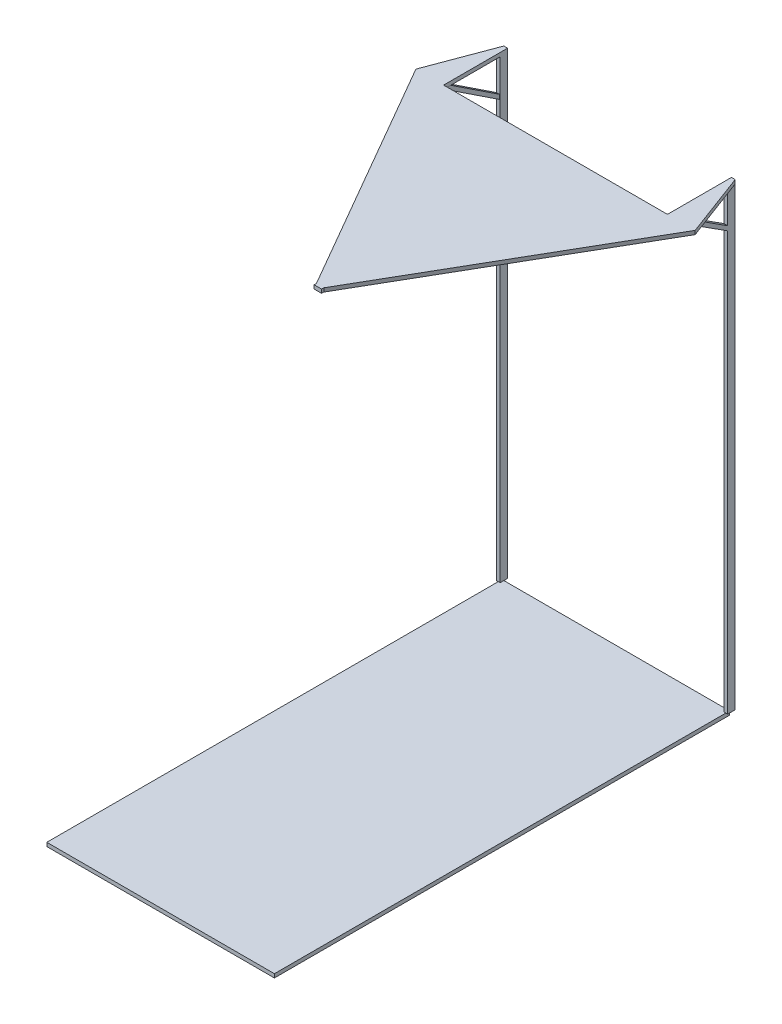
ISO-10303-21;
HEADER;
FILE_DESCRIPTION(('STEP AP214'),'2;1');
FILE_NAME('part.step','',(''),(''),'','','');
FILE_SCHEMA(('AUTOMOTIVE_DESIGN { 1 0 10303 214 1 1 1 1 }'));
ENDSEC;
DATA;
#1=APPLICATION_CONTEXT('core data for automotive mechanical design processes');
#2=APPLICATION_PROTOCOL_DEFINITION('international standard','automotive_design',2000,#1);
#3=PRODUCT_CONTEXT('',#1,'mechanical');
#4=PRODUCT('Part','Part','',(#3));
#5=PRODUCT_RELATED_PRODUCT_CATEGORY('part','',(#4));
#6=PRODUCT_DEFINITION_FORMATION('','',#4);
#7=PRODUCT_DEFINITION_CONTEXT('part definition',#1,'design');
#8=PRODUCT_DEFINITION('design','',#6,#7);
#9=PRODUCT_DEFINITION_SHAPE('','',#8);
#10=(LENGTH_UNIT() NAMED_UNIT(*) SI_UNIT(.MILLI.,.METRE.));
#11=(NAMED_UNIT(*) PLANE_ANGLE_UNIT() SI_UNIT($,.RADIAN.));
#12=(NAMED_UNIT(*) SI_UNIT($,.STERADIAN.) SOLID_ANGLE_UNIT());
#13=UNCERTAINTY_MEASURE_WITH_UNIT(LENGTH_MEASURE(1.E-05),#10,'distance_accuracy_value','');
#14=(GEOMETRIC_REPRESENTATION_CONTEXT(3) GLOBAL_UNCERTAINTY_ASSIGNED_CONTEXT((#13)) GLOBAL_UNIT_ASSIGNED_CONTEXT((#10,
#11,#12)) REPRESENTATION_CONTEXT('',''));
#15=CARTESIAN_POINT('',(0.,0.,0.));
#16=DIRECTION('',(0.,0.,1.));
#17=DIRECTION('',(1.,0.,0.));
#18=AXIS2_PLACEMENT_3D('',#15,#16,#17);
#19=CARTESIAN_POINT('',(0.,615.,0.));
#20=DIRECTION('',(0.,-1.,0.));
#21=DIRECTION('',(0.,0.,-1.));
#22=AXIS2_PLACEMENT_3D('',#19,#20,#21);
#23=PLANE('',#22);
#24=DIRECTION('',(0.,0.,1.));
#25=VECTOR('',#24,1.);
#26=CARTESIAN_POINT('',(-150.9,615.,0.));
#27=LINE('',#26,#25);
#28=CARTESIAN_POINT('',(-150.9,615.,-233.171995957836));
#29=VERTEX_POINT('',#28);
#30=CARTESIAN_POINT('',(-150.9,615.,-224.099772141224));
#31=VERTEX_POINT('',#30);
#32=EDGE_CURVE('E409',#29,#31,#27,.T.);
#33=ORIENTED_EDGE('',*,*,#32,.F.);
#34=DIRECTION('',(1.,0.,0.));
#35=VECTOR('',#34,1.);
#36=CARTESIAN_POINT('',(0.,615.,-233.171995957836));
#37=LINE('',#36,#35);
#38=CARTESIAN_POINT('',(-154.9,615.,-233.171995957836));
#39=VERTEX_POINT('',#38);
#40=EDGE_CURVE('E407',#39,#29,#37,.T.);
#41=ORIENTED_EDGE('',*,*,#40,.F.);
#42=DIRECTION('',(0.,0.,1.));
#43=VECTOR('',#42,1.);
#44=CARTESIAN_POINT('',(-154.9,615.,0.));
#45=LINE('',#44,#43);
#46=CARTESIAN_POINT('',(-154.9,615.,-224.099772141224));
#47=VERTEX_POINT('',#46);
#48=EDGE_CURVE('E404',#39,#47,#45,.T.);
#49=ORIENTED_EDGE('',*,*,#48,.T.);
#50=DIRECTION('',(-1.,0.,0.));
#51=VECTOR('',#50,1.);
#52=CARTESIAN_POINT('',(-150.9,615.,-224.099772141224));
#53=LINE('',#52,#51);
#54=EDGE_CURVE('E457',#31,#47,#53,.T.);
#55=ORIENTED_EDGE('',*,*,#54,.F.);
#56=EDGE_LOOP('',(#33,#41,#49,#55));
#57=FACE_BOUND('',#56,.T.);
#58=DIRECTION('',(0.,0.,-1.));
#59=VECTOR('',#58,1.);
#60=CARTESIAN_POINT('',(4.99999999999996,615.,91.1334748363122));
#61=LINE('',#60,#59);
#62=CARTESIAN_POINT('',(5.,615.,94.1430586713743));
#63=VERTEX_POINT('',#62);
#64=CARTESIAN_POINT('',(4.99999999999996,615.,91.1334748363122));
#65=VERTEX_POINT('',#64);
#66=EDGE_CURVE('E266',#63,#65,#61,.T.);
#67=ORIENTED_EDGE('',*,*,#66,.F.);
#68=DIRECTION('',(-1.,0.,0.));
#69=VECTOR('',#68,1.);
#70=CARTESIAN_POINT('',(0.,615.,94.1430586713743));
#71=LINE('',#70,#69);
#72=CARTESIAN_POINT('',(-4.99999999999999,615.,94.1430586713743));
#73=VERTEX_POINT('',#72);
#74=EDGE_CURVE('E252',#63,#73,#71,.T.);
#75=ORIENTED_EDGE('',*,*,#74,.T.);
#76=DIRECTION('',(0.,0.,1.));
#77=VECTOR('',#76,1.);
#78=CARTESIAN_POINT('',(-4.99999999999999,615.,99.7999999999999));
#79=LINE('',#78,#77);
#80=CARTESIAN_POINT('',(-4.99999999999993,615.,91.1334748363122));
#81=VERTEX_POINT('',#80);
#82=EDGE_CURVE('E251',#81,#73,#79,.T.);
#83=ORIENTED_EDGE('',*,*,#82,.F.);
#84=DIRECTION('',(0.5,0.,0.866025403784439));
#85=VECTOR('',#84,1.);
#86=CARTESIAN_POINT('',(-187.,615.,-224.099772141224));
#87=LINE('',#86,#85);
#88=CARTESIAN_POINT('',(-187.,615.,-224.099772141224));
#89=VERTEX_POINT('',#88);
#90=EDGE_CURVE('E284',#89,#81,#87,.T.);
#91=ORIENTED_EDGE('',*,*,#90,.F.);
#92=DIRECTION('',(-0.350763346399041,0.,0.936464134296101));
#93=VECTOR('',#92,1.);
#94=CARTESIAN_POINT('',(-154.9,615.,-309.8));
#95=LINE('',#94,#93);
#96=CARTESIAN_POINT('',(-154.9,615.,-309.8));
#97=VERTEX_POINT('',#96);
#98=EDGE_CURVE('E282',#97,#89,#95,.T.);
#99=ORIENTED_EDGE('',*,*,#98,.F.);
#100=DIRECTION('',(0.,0.,1.));
#101=VECTOR('',#100,1.);
#102=CARTESIAN_POINT('',(-154.9,615.,-309.8));
#103=LINE('',#102,#101);
#104=CARTESIAN_POINT('',(-154.9,615.,-299.8));
#105=VERTEX_POINT('',#104);
#106=EDGE_CURVE('E313',#97,#105,#103,.T.);
#107=ORIENTED_EDGE('',*,*,#106,.T.);
#108=DIRECTION('',(1.,0.,0.));
#109=VECTOR('',#108,1.);
#110=CARTESIAN_POINT('',(-154.9,615.,-299.8));
#111=LINE('',#110,#109);
#112=CARTESIAN_POINT('',(-149.9,615.,-299.8));
#113=VERTEX_POINT('',#112);
#114=EDGE_CURVE('E336',#105,#113,#111,.T.);
#115=ORIENTED_EDGE('',*,*,#114,.T.);
#116=DIRECTION('',(0.,0.,-1.));
#117=VECTOR('',#116,1.);
#118=CARTESIAN_POINT('',(-149.9,615.,-224.099772141224));
#119=LINE('',#118,#117);
#120=CARTESIAN_POINT('',(-149.9,615.,-224.099772141224));
#121=VERTEX_POINT('',#120);
#122=EDGE_CURVE('E279',#121,#113,#119,.T.);
#123=ORIENTED_EDGE('',*,*,#122,.F.);
#124=DIRECTION('',(-1.,0.,0.));
#125=VECTOR('',#124,1.);
#126=CARTESIAN_POINT('',(-149.9,615.,-224.099772141224));
#127=LINE('',#126,#125);
#128=CARTESIAN_POINT('',(149.9,615.,-224.099772141224));
#129=VERTEX_POINT('',#128);
#130=EDGE_CURVE('E277',#129,#121,#127,.T.);
#131=ORIENTED_EDGE('',*,*,#130,.F.);
#132=DIRECTION('',(0.,0.,-1.));
#133=VECTOR('',#132,1.);
#134=CARTESIAN_POINT('',(149.9,615.,0.));
#135=LINE('',#134,#133);
#136=CARTESIAN_POINT('',(149.9,615.,-222.633348802618));
#137=VERTEX_POINT('',#136);
#138=EDGE_CURVE('E426',#137,#129,#135,.T.);
#139=ORIENTED_EDGE('',*,*,#138,.F.);
#140=DIRECTION('',(-1.,0.,0.));
#141=VECTOR('',#140,1.);
#142=CARTESIAN_POINT('',(0.,615.,-222.633348802618));
#143=LINE('',#142,#141);
#144=CARTESIAN_POINT('',(154.9,615.,-222.633348802618));
#145=VERTEX_POINT('',#144);
#146=EDGE_CURVE('E47',#145,#137,#143,.T.);
#147=ORIENTED_EDGE('',*,*,#146,.F.);
#148=DIRECTION('',(0.,0.,-1.));
#149=VECTOR('',#148,1.);
#150=CARTESIAN_POINT('',(154.9,615.,0.));
#151=LINE('',#150,#149);
#152=CARTESIAN_POINT('',(154.9,615.,-231.890701946567));
#153=VERTEX_POINT('',#152);
#154=EDGE_CURVE('E435',#145,#153,#151,.T.);
#155=ORIENTED_EDGE('',*,*,#154,.T.);
#156=DIRECTION('',(-1.,0.,0.));
#157=VECTOR('',#156,1.);
#158=CARTESIAN_POINT('',(0.,615.,-231.890701946567));
#159=LINE('',#158,#157);
#160=CARTESIAN_POINT('',(149.9,615.,-231.890701946567));
#161=VERTEX_POINT('',#160);
#162=EDGE_CURVE('E434',#153,#161,#159,.T.);
#163=ORIENTED_EDGE('',*,*,#162,.T.);
#164=DIRECTION('',(0.,0.,1.));
#165=VECTOR('',#164,1.);
#166=CARTESIAN_POINT('',(149.9,615.,-309.8));
#167=LINE('',#166,#165);
#168=CARTESIAN_POINT('',(149.9,615.,-299.8));
#169=VERTEX_POINT('',#168);
#170=EDGE_CURVE('E274',#169,#161,#167,.T.);
#171=ORIENTED_EDGE('',*,*,#170,.F.);
#172=DIRECTION('',(-1.,0.,0.));
#173=VECTOR('',#172,1.);
#174=CARTESIAN_POINT('',(154.9,615.,-299.8));
#175=LINE('',#174,#173);
#176=CARTESIAN_POINT('',(154.9,615.,-299.8));
#177=VERTEX_POINT('',#176);
#178=EDGE_CURVE('E339',#177,#169,#175,.T.);
#179=ORIENTED_EDGE('',*,*,#178,.F.);
#180=DIRECTION('',(0.,0.,-1.));
#181=VECTOR('',#180,1.);
#182=CARTESIAN_POINT('',(154.9,615.,-299.8));
#183=LINE('',#182,#181);
#184=CARTESIAN_POINT('',(154.9,615.,-309.8));
#185=VERTEX_POINT('',#184);
#186=EDGE_CURVE('E365',#177,#185,#183,.T.);
#187=ORIENTED_EDGE('',*,*,#186,.T.);
#188=DIRECTION('',(-0.350763346399043,0.,-0.9364641342961));
#189=VECTOR('',#188,1.);
#190=CARTESIAN_POINT('',(187.,615.,-224.099772141224));
#191=LINE('',#190,#189);
#192=CARTESIAN_POINT('',(187.,615.,-224.099772141224));
#193=VERTEX_POINT('',#192);
#194=EDGE_CURVE('E271',#193,#185,#191,.T.);
#195=ORIENTED_EDGE('',*,*,#194,.F.);
#196=DIRECTION('',(0.5,0.,-0.866025403784439));
#197=VECTOR('',#196,1.);
#198=CARTESIAN_POINT('',(187.,615.,-224.099772141224));
#199=LINE('',#198,#197);
#200=EDGE_CURVE('E268',#65,#193,#199,.T.);
#201=ORIENTED_EDGE('',*,*,#200,.F.);
#202=EDGE_LOOP('',(#67,#75,#83,#91,#99,#107,#115,#123,#131,#139,#147,#155,#163,#171,#179,#187,
#195,#201));
#203=FACE_BOUND('',#202,.T.);
#204=ADVANCED_FACE('F39',(#57,#203),#23,.T.);
#205=CARTESIAN_POINT('',(4.99999999999996,620.,91.1334748363122));
#206=DIRECTION('',(-1.,0.,0.));
#207=DIRECTION('',(0.,0.,1.));
#208=AXIS2_PLACEMENT_3D('',#205,#206,#207);
#209=PLANE('',#208);
#210=DIRECTION('',(0.,1.,0.));
#211=VECTOR('',#210,1.);
#212=CARTESIAN_POINT('',(4.99999999999997,620.,94.1430586713743));
#213=LINE('',#212,#211);
#214=CARTESIAN_POINT('',(5.00000000000002,620.,94.1430586713743));
#215=VERTEX_POINT('',#214);
#216=EDGE_CURVE('E53',#63,#215,#213,.T.);
#217=ORIENTED_EDGE('',*,*,#216,.F.);
#218=ORIENTED_EDGE('',*,*,#66,.T.);
#219=DIRECTION('',(0.,-1.,0.));
#220=VECTOR('',#219,1.);
#221=CARTESIAN_POINT('',(4.99999999999996,620.,91.1334748363122));
#222=LINE('',#221,#220);
#223=CARTESIAN_POINT('',(4.99999999999996,620.,91.1334748363122));
#224=VERTEX_POINT('',#223);
#225=EDGE_CURVE('E306',#224,#65,#222,.T.);
#226=ORIENTED_EDGE('',*,*,#225,.F.);
#227=DIRECTION('',(0.,0.,-1.));
#228=VECTOR('',#227,1.);
#229=CARTESIAN_POINT('',(5.00000000000002,620.,104.787457748313));
#230=LINE('',#229,#228);
#231=EDGE_CURVE('E287',#215,#224,#230,.T.);
#232=ORIENTED_EDGE('',*,*,#231,.F.);
#233=EDGE_LOOP('',(#217,#218,#226,#232));
#234=FACE_BOUND('',#233,.T.);
#235=ADVANCED_FACE('F607',(#234),#209,.F.);
#236=CARTESIAN_POINT('',(-4.99999999999999,620.,99.7999999999999));
#237=DIRECTION('',(1.,0.,0.));
#238=DIRECTION('',(0.,0.,-1.));
#239=AXIS2_PLACEMENT_3D('',#236,#237,#238);
#240=PLANE('',#239);
#241=DIRECTION('',(0.,-1.,0.));
#242=VECTOR('',#241,1.);
#243=CARTESIAN_POINT('',(-4.99999999999999,620.,94.1430586713743));
#244=LINE('',#243,#242);
#245=CARTESIAN_POINT('',(-4.99999999999995,620.,94.1430586713743));
#246=VERTEX_POINT('',#245);
#247=EDGE_CURVE('E240',#246,#73,#244,.T.);
#248=ORIENTED_EDGE('',*,*,#247,.F.);
#249=DIRECTION('',(0.,0.,1.));
#250=VECTOR('',#249,1.);
#251=CARTESIAN_POINT('',(-4.99999999999999,620.,99.7999999999999));
#252=LINE('',#251,#250);
#253=CARTESIAN_POINT('',(-4.99999999999993,620.,91.1334748363122));
#254=VERTEX_POINT('',#253);
#255=EDGE_CURVE('E250',#254,#246,#252,.T.);
#256=ORIENTED_EDGE('',*,*,#255,.F.);
#257=DIRECTION('',(0.,-1.,0.));
#258=VECTOR('',#257,1.);
#259=CARTESIAN_POINT('',(-4.99999999999993,620.,91.1334748363122));
#260=LINE('',#259,#258);
#261=EDGE_CURVE('E258',#254,#81,#260,.T.);
#262=ORIENTED_EDGE('',*,*,#261,.T.);
#263=ORIENTED_EDGE('',*,*,#82,.T.);
#264=EDGE_LOOP('',(#248,#256,#262,#263));
#265=FACE_BOUND('',#264,.T.);
#266=ADVANCED_FACE('F248',(#265),#240,.F.);
#267=CARTESIAN_POINT('',(0.,620.,0.));
#268=DIRECTION('',(0.,-1.,0.));
#269=DIRECTION('',(0.,0.,-1.));
#270=AXIS2_PLACEMENT_3D('',#267,#268,#269);
#271=PLANE('',#270);
#272=DIRECTION('',(-1.,0.,0.));
#273=VECTOR('',#272,1.);
#274=CARTESIAN_POINT('',(0.,620.,94.1430586713743));
#275=LINE('',#274,#273);
#276=EDGE_CURVE('E11',#215,#246,#275,.T.);
#277=ORIENTED_EDGE('',*,*,#276,.F.);
#278=ORIENTED_EDGE('',*,*,#231,.T.);
#279=DIRECTION('',(0.5,0.,-0.866025403784439));
#280=VECTOR('',#279,1.);
#281=CARTESIAN_POINT('',(187.,620.,-224.099772141224));
#282=LINE('',#281,#280);
#283=CARTESIAN_POINT('',(187.,620.,-224.099772141224));
#284=VERTEX_POINT('',#283);
#285=EDGE_CURVE('E468',#224,#284,#282,.T.);
#286=ORIENTED_EDGE('',*,*,#285,.T.);
#287=DIRECTION('',(-0.350763346399043,0.,-0.9364641342961));
#288=VECTOR('',#287,1.);
#289=CARTESIAN_POINT('',(187.,620.,-224.099772141224));
#290=LINE('',#289,#288);
#291=CARTESIAN_POINT('',(154.9,620.,-309.8));
#292=VERTEX_POINT('',#291);
#293=EDGE_CURVE('E470',#284,#292,#290,.T.);
#294=ORIENTED_EDGE('',*,*,#293,.T.);
#295=DIRECTION('',(-1.,0.,0.));
#296=VECTOR('',#295,1.);
#297=CARTESIAN_POINT('',(154.9,620.,-309.8));
#298=LINE('',#297,#296);
#299=CARTESIAN_POINT('',(149.9,620.,-309.8));
#300=VERTEX_POINT('',#299);
#301=EDGE_CURVE('E472',#292,#300,#298,.T.);
#302=ORIENTED_EDGE('',*,*,#301,.T.);
#303=DIRECTION('',(0.,0.,1.));
#304=VECTOR('',#303,1.);
#305=CARTESIAN_POINT('',(149.9,620.,-309.8));
#306=LINE('',#305,#304);
#307=CARTESIAN_POINT('',(149.9,620.,-224.099772141224));
#308=VERTEX_POINT('',#307);
#309=EDGE_CURVE('E475',#300,#308,#306,.T.);
#310=ORIENTED_EDGE('',*,*,#309,.T.);
#311=DIRECTION('',(-1.,0.,0.));
#312=VECTOR('',#311,1.);
#313=CARTESIAN_POINT('',(-149.9,620.,-224.099772141224));
#314=LINE('',#313,#312);
#315=CARTESIAN_POINT('',(-149.9,620.,-224.099772141224));
#316=VERTEX_POINT('',#315);
#317=EDGE_CURVE('E477',#308,#316,#314,.T.);
#318=ORIENTED_EDGE('',*,*,#317,.T.);
#319=DIRECTION('',(0.,0.,-1.));
#320=VECTOR('',#319,1.);
#321=CARTESIAN_POINT('',(-149.9,620.,-224.099772141224));
#322=LINE('',#321,#320);
#323=CARTESIAN_POINT('',(-149.9,620.,-309.8));
#324=VERTEX_POINT('',#323);
#325=EDGE_CURVE('E479',#316,#324,#322,.T.);
#326=ORIENTED_EDGE('',*,*,#325,.T.);
#327=DIRECTION('',(-1.,0.,0.));
#328=VECTOR('',#327,1.);
#329=CARTESIAN_POINT('',(-154.9,620.,-309.8));
#330=LINE('',#329,#328);
#331=CARTESIAN_POINT('',(-154.9,620.,-309.8));
#332=VERTEX_POINT('',#331);
#333=EDGE_CURVE('E482',#324,#332,#330,.T.);
#334=ORIENTED_EDGE('',*,*,#333,.T.);
#335=DIRECTION('',(-0.350763346399041,0.,0.936464134296101));
#336=VECTOR('',#335,1.);
#337=CARTESIAN_POINT('',(-154.9,620.,-309.8));
#338=LINE('',#337,#336);
#339=CARTESIAN_POINT('',(-187.,620.,-224.099772141224));
#340=VERTEX_POINT('',#339);
#341=EDGE_CURVE('E262',#332,#340,#338,.T.);
#342=ORIENTED_EDGE('',*,*,#341,.T.);
#343=DIRECTION('',(0.5,0.,0.866025403784439));
#344=VECTOR('',#343,1.);
#345=CARTESIAN_POINT('',(-187.,620.,-224.099772141224));
#346=LINE('',#345,#344);
#347=EDGE_CURVE('E256',#340,#254,#346,.T.);
#348=ORIENTED_EDGE('',*,*,#347,.T.);
#349=ORIENTED_EDGE('',*,*,#255,.T.);
#350=EDGE_LOOP('',(#277,#278,#286,#294,#302,#310,#318,#326,#334,#342,#348,#349));
#351=FACE_BOUND('',#350,.T.);
#352=ADVANCED_FACE('F254',(#351),#271,.F.);
#353=CARTESIAN_POINT('',(154.9,5.,-299.8));
#354=DIRECTION('',(0.,0.,1.));
#355=DIRECTION('',(1.,0.,0.));
#356=AXIS2_PLACEMENT_3D('',#353,#354,#355);
#357=PLANE('',#356);
#358=DIRECTION('',(0.,1.,0.));
#359=VECTOR('',#358,1.);
#360=CARTESIAN_POINT('',(149.9,5.,-299.8));
#361=LINE('',#360,#359);
#362=CARTESIAN_POINT('',(149.9,571.417719225978,-299.8));
#363=VERTEX_POINT('',#362);
#364=EDGE_CURVE('E352',#363,#169,#361,.T.);
#365=ORIENTED_EDGE('',*,*,#364,.F.);
#366=DIRECTION('',(1.,0.,0.));
#367=VECTOR('',#366,1.);
#368=CARTESIAN_POINT('',(154.9,571.417719225978,-299.8));
#369=LINE('',#368,#367);
#370=CARTESIAN_POINT('',(154.9,571.417719225978,-299.8));
#371=VERTEX_POINT('',#370);
#372=EDGE_CURVE('E438',#363,#371,#369,.T.);
#373=ORIENTED_EDGE('',*,*,#372,.T.);
#374=DIRECTION('',(0.,1.,0.));
#375=VECTOR('',#374,1.);
#376=CARTESIAN_POINT('',(154.9,5.,-299.8));
#377=LINE('',#376,#375);
#378=EDGE_CURVE('E363',#371,#177,#377,.T.);
#379=ORIENTED_EDGE('',*,*,#378,.T.);
#380=ORIENTED_EDGE('',*,*,#178,.T.);
#381=EDGE_LOOP('',(#365,#373,#379,#380));
#382=FACE_BOUND('',#381,.T.);
#383=ADVANCED_FACE('F509',(#382),#357,.T.);
#384=CARTESIAN_POINT('',(0.,5.,0.));
#385=DIRECTION('',(0.,1.,0.));
#386=DIRECTION('',(0.,0.,1.));
#387=AXIS2_PLACEMENT_3D('',#384,#385,#386);
#388=PLANE('',#387);
#389=DIRECTION('',(0.,0.,1.));
#390=VECTOR('',#389,1.);
#391=CARTESIAN_POINT('',(-152.4,5.,-304.8));
#392=LINE('',#391,#390);
#393=CARTESIAN_POINT('',(-152.4,5.,-299.8));
#394=VERTEX_POINT('',#393);
#395=CARTESIAN_POINT('',(-152.4,4.99999999999967,304.8));
#396=VERTEX_POINT('',#395);
#397=EDGE_CURVE('E375',#394,#396,#392,.T.);
#398=ORIENTED_EDGE('',*,*,#397,.T.);
#399=DIRECTION('',(1.,0.,0.));
#400=VECTOR('',#399,1.);
#401=CARTESIAN_POINT('',(-152.4,5.,304.8));
#402=LINE('',#401,#400);
#403=CARTESIAN_POINT('',(152.4,4.99999999999967,304.8));
#404=VERTEX_POINT('',#403);
#405=EDGE_CURVE('E380',#396,#404,#402,.T.);
#406=ORIENTED_EDGE('',*,*,#405,.T.);
#407=DIRECTION('',(0.,0.,-1.));
#408=VECTOR('',#407,1.);
#409=CARTESIAN_POINT('',(152.4,5.,-304.8));
#410=LINE('',#409,#408);
#411=CARTESIAN_POINT('',(152.4,5.,-299.8));
#412=VERTEX_POINT('',#411);
#413=EDGE_CURVE('E369',#404,#412,#410,.T.);
#414=ORIENTED_EDGE('',*,*,#413,.T.);
#415=DIRECTION('',(-1.,0.,0.));
#416=VECTOR('',#415,1.);
#417=CARTESIAN_POINT('',(154.9,5.,-299.8));
#418=LINE('',#417,#416);
#419=CARTESIAN_POINT('',(149.9,5.,-299.8));
#420=VERTEX_POINT('',#419);
#421=EDGE_CURVE('E346',#412,#420,#418,.T.);
#422=ORIENTED_EDGE('',*,*,#421,.T.);
#423=DIRECTION('',(0.,0.,1.));
#424=VECTOR('',#423,1.);
#425=CARTESIAN_POINT('',(149.9,5.,-309.8));
#426=LINE('',#425,#424);
#427=CARTESIAN_POINT('',(149.9,5.,-304.8));
#428=VERTEX_POINT('',#427);
#429=EDGE_CURVE('E354',#428,#420,#426,.T.);
#430=ORIENTED_EDGE('',*,*,#429,.F.);
#431=DIRECTION('',(-1.,0.,0.));
#432=VECTOR('',#431,1.);
#433=CARTESIAN_POINT('',(-152.4,5.,-304.8));
#434=LINE('',#433,#432);
#435=CARTESIAN_POINT('',(-149.9,5.,-304.8));
#436=VERTEX_POINT('',#435);
#437=EDGE_CURVE('E376',#428,#436,#434,.T.);
#438=ORIENTED_EDGE('',*,*,#437,.T.);
#439=DIRECTION('',(0.,0.,-1.));
#440=VECTOR('',#439,1.);
#441=CARTESIAN_POINT('',(-149.9,5.,-299.8));
#442=LINE('',#441,#440);
#443=CARTESIAN_POINT('',(-149.9,5.,-299.8));
#444=VERTEX_POINT('',#443);
#445=EDGE_CURVE('E328',#444,#436,#442,.T.);
#446=ORIENTED_EDGE('',*,*,#445,.F.);
#447=DIRECTION('',(-1.,0.,0.));
#448=VECTOR('',#447,1.);
#449=CARTESIAN_POINT('',(0.,5.,-299.8));
#450=LINE('',#449,#448);
#451=EDGE_CURVE('E402',#444,#394,#450,.T.);
#452=ORIENTED_EDGE('',*,*,#451,.T.);
#453=EDGE_LOOP('',(#398,#406,#414,#422,#430,#438,#446,#452));
#454=FACE_BOUND('',#453,.T.);
#455=ADVANCED_FACE('F567',(#454),#388,.T.);
#456=CARTESIAN_POINT('',(152.4,5.,-304.8));
#457=DIRECTION('',(-1.,0.,0.));
#458=DIRECTION('',(0.,0.,1.));
#459=AXIS2_PLACEMENT_3D('',#456,#457,#458);
#460=PLANE('',#459);
#461=DIRECTION('',(0.,0.,-1.));
#462=VECTOR('',#461,1.);
#463=CARTESIAN_POINT('',(152.4,0.,-304.8));
#464=LINE('',#463,#462);
#465=CARTESIAN_POINT('',(152.4,0.,304.8));
#466=VERTEX_POINT('',#465);
#467=CARTESIAN_POINT('',(152.4,0.,-304.8));
#468=VERTEX_POINT('',#467);
#469=EDGE_CURVE('E360',#466,#468,#464,.T.);
#470=ORIENTED_EDGE('',*,*,#469,.T.);
#471=DIRECTION('',(0.,-1.,0.));
#472=VECTOR('',#471,1.);
#473=CARTESIAN_POINT('',(152.4,5.,-304.8));
#474=LINE('',#473,#472);
#475=CARTESIAN_POINT('',(152.4,5.,-304.8));
#476=VERTEX_POINT('',#475);
#477=EDGE_CURVE('E399',#476,#468,#474,.T.);
#478=ORIENTED_EDGE('',*,*,#477,.F.);
#479=EDGE_CURVE('E372',#412,#476,#410,.T.);
#480=ORIENTED_EDGE('',*,*,#479,.F.);
#481=ORIENTED_EDGE('',*,*,#413,.F.);
#482=DIRECTION('',(0.,-1.,0.));
#483=VECTOR('',#482,1.);
#484=CARTESIAN_POINT('',(152.4,5.,304.8));
#485=LINE('',#484,#483);
#486=EDGE_CURVE('E382',#404,#466,#485,.T.);
#487=ORIENTED_EDGE('',*,*,#486,.T.);
#488=EDGE_LOOP('',(#470,#478,#480,#481,#487));
#489=FACE_BOUND('',#488,.T.);
#490=ADVANCED_FACE('F41',(#489),#460,.F.);
#491=CARTESIAN_POINT('',(-152.4,5.,-304.8));
#492=DIRECTION('',(0.,0.,1.));
#493=DIRECTION('',(1.,0.,0.));
#494=AXIS2_PLACEMENT_3D('',#491,#492,#493);
#495=PLANE('',#494);
#496=DIRECTION('',(-1.,0.,0.));
#497=VECTOR('',#496,1.);
#498=CARTESIAN_POINT('',(-152.4,0.,-304.8));
#499=LINE('',#498,#497);
#500=CARTESIAN_POINT('',(-152.4,0.,-304.8));
#501=VERTEX_POINT('',#500);
#502=EDGE_CURVE('E385',#468,#501,#499,.T.);
#503=ORIENTED_EDGE('',*,*,#502,.T.);
#504=DIRECTION('',(0.,-1.,0.));
#505=VECTOR('',#504,1.);
#506=CARTESIAN_POINT('',(-152.4,5.,-304.8));
#507=LINE('',#506,#505);
#508=CARTESIAN_POINT('',(-152.4,5.,-304.8));
#509=VERTEX_POINT('',#508);
#510=EDGE_CURVE('E396',#509,#501,#507,.T.);
#511=ORIENTED_EDGE('',*,*,#510,.F.);
#512=EDGE_CURVE('E371',#436,#509,#434,.T.);
#513=ORIENTED_EDGE('',*,*,#512,.F.);
#514=ORIENTED_EDGE('',*,*,#437,.F.);
#515=EDGE_CURVE('E373',#476,#428,#434,.T.);
#516=ORIENTED_EDGE('',*,*,#515,.F.);
#517=ORIENTED_EDGE('',*,*,#477,.T.);
#518=EDGE_LOOP('',(#503,#511,#513,#514,#516,#517));
#519=FACE_BOUND('',#518,.T.);
#520=ADVANCED_FACE('F575',(#519),#495,.F.);
#521=CARTESIAN_POINT('',(-152.4,5.,-304.8));
#522=DIRECTION('',(1.,0.,0.));
#523=DIRECTION('',(0.,0.,-1.));
#524=AXIS2_PLACEMENT_3D('',#521,#522,#523);
#525=PLANE('',#524);
#526=DIRECTION('',(0.,0.,1.));
#527=VECTOR('',#526,1.);
#528=CARTESIAN_POINT('',(-152.4,0.,-304.8));
#529=LINE('',#528,#527);
#530=CARTESIAN_POINT('',(-152.4,0.,304.8));
#531=VERTEX_POINT('',#530);
#532=EDGE_CURVE('E387',#501,#531,#529,.T.);
#533=ORIENTED_EDGE('',*,*,#532,.T.);
#534=DIRECTION('',(0.,-1.,0.));
#535=VECTOR('',#534,1.);
#536=CARTESIAN_POINT('',(-152.4,5.,304.8));
#537=LINE('',#536,#535);
#538=EDGE_CURVE('E393',#396,#531,#537,.T.);
#539=ORIENTED_EDGE('',*,*,#538,.F.);
#540=ORIENTED_EDGE('',*,*,#397,.F.);
#541=EDGE_CURVE('E377',#509,#394,#392,.T.);
#542=ORIENTED_EDGE('',*,*,#541,.F.);
#543=ORIENTED_EDGE('',*,*,#510,.T.);
#544=EDGE_LOOP('',(#533,#539,#540,#542,#543));
#545=FACE_BOUND('',#544,.T.);
#546=ADVANCED_FACE('F578',(#545),#525,.F.);
#547=CARTESIAN_POINT('',(-152.4,5.,304.8));
#548=DIRECTION('',(0.,0.,-1.));
#549=DIRECTION('',(-1.,0.,0.));
#550=AXIS2_PLACEMENT_3D('',#547,#548,#549);
#551=PLANE('',#550);
#552=DIRECTION('',(1.,0.,0.));
#553=VECTOR('',#552,1.);
#554=CARTESIAN_POINT('',(-152.4,0.,304.8));
#555=LINE('',#554,#553);
#556=EDGE_CURVE('E389',#531,#466,#555,.T.);
#557=ORIENTED_EDGE('',*,*,#556,.T.);
#558=ORIENTED_EDGE('',*,*,#486,.F.);
#559=ORIENTED_EDGE('',*,*,#405,.F.);
#560=ORIENTED_EDGE('',*,*,#538,.T.);
#561=EDGE_LOOP('',(#557,#558,#559,#560));
#562=FACE_BOUND('',#561,.T.);
#563=ADVANCED_FACE('F585',(#562),#551,.F.);
#564=CARTESIAN_POINT('',(0.,0.,0.));
#565=DIRECTION('',(0.,1.,0.));
#566=DIRECTION('',(0.,0.,1.));
#567=AXIS2_PLACEMENT_3D('',#564,#565,#566);
#568=PLANE('',#567);
#569=ORIENTED_EDGE('',*,*,#469,.F.);
#570=ORIENTED_EDGE('',*,*,#556,.F.);
#571=ORIENTED_EDGE('',*,*,#532,.F.);
#572=ORIENTED_EDGE('',*,*,#502,.F.);
#573=EDGE_LOOP('',(#569,#570,#571,#572));
#574=FACE_BOUND('',#573,.T.);
#575=ADVANCED_FACE('F594',(#574),#568,.F.);
#576=CARTESIAN_POINT('',(154.9,5.,-309.8));
#577=DIRECTION('',(0.,0.,1.));
#578=DIRECTION('',(1.,0.,0.));
#579=AXIS2_PLACEMENT_3D('',#576,#577,#578);
#580=PLANE('',#579);
#581=DIRECTION('',(0.,-1.,0.));
#582=VECTOR('',#581,1.);
#583=CARTESIAN_POINT('',(154.9,620.,-309.8));
#584=LINE('',#583,#582);
#585=EDGE_CURVE('E300',#292,#185,#584,.T.);
#586=ORIENTED_EDGE('',*,*,#585,.T.);
#587=DIRECTION('',(0.,1.,0.));
#588=VECTOR('',#587,1.);
#589=CARTESIAN_POINT('',(154.9,5.,-309.8));
#590=LINE('',#589,#588);
#591=CARTESIAN_POINT('',(154.9,5.,-309.8));
#592=VERTEX_POINT('',#591);
#593=EDGE_CURVE('E353',#592,#185,#590,.T.);
#594=ORIENTED_EDGE('',*,*,#593,.F.);
#595=DIRECTION('',(-1.,0.,0.));
#596=VECTOR('',#595,1.);
#597=CARTESIAN_POINT('',(154.9,5.,-309.8));
#598=LINE('',#597,#596);
#599=CARTESIAN_POINT('',(149.9,5.,-309.8));
#600=VERTEX_POINT('',#599);
#601=EDGE_CURVE('E345',#592,#600,#598,.T.);
#602=ORIENTED_EDGE('',*,*,#601,.T.);
#603=DIRECTION('',(0.,1.,0.));
#604=VECTOR('',#603,1.);
#605=CARTESIAN_POINT('',(149.9,5.,-309.8));
#606=LINE('',#605,#604);
#607=EDGE_CURVE('E358',#600,#300,#606,.T.);
#608=ORIENTED_EDGE('',*,*,#607,.T.);
#609=ORIENTED_EDGE('',*,*,#301,.F.);
#610=EDGE_LOOP('',(#586,#594,#602,#608,#609));
#611=FACE_BOUND('',#610,.T.);
#612=ADVANCED_FACE('F520',(#611),#580,.F.);
#613=DIRECTION('',(1.,0.,0.));
#614=VECTOR('',#613,1.);
#615=CARTESIAN_POINT('',(154.9,565.476609900619,-299.8));
#616=LINE('',#615,#614);
#617=CARTESIAN_POINT('',(149.9,565.476609900619,-299.8));
#618=VERTEX_POINT('',#617);
#619=CARTESIAN_POINT('',(154.9,565.476609900619,-299.8));
#620=VERTEX_POINT('',#619);
#621=EDGE_CURVE('E445',#618,#620,#616,.T.);
#622=ORIENTED_EDGE('',*,*,#621,.F.);
#623=EDGE_CURVE('E355',#420,#618,#361,.T.);
#624=ORIENTED_EDGE('',*,*,#623,.F.);
#625=ORIENTED_EDGE('',*,*,#421,.F.);
#626=CARTESIAN_POINT('',(154.9,5.,-299.8));
#627=VERTEX_POINT('',#626);
#628=EDGE_CURVE('E342',#627,#412,#418,.T.);
#629=ORIENTED_EDGE('',*,*,#628,.F.);
#630=EDGE_CURVE('E61',#627,#620,#377,.T.);
#631=ORIENTED_EDGE('',*,*,#630,.T.);
#632=EDGE_LOOP('',(#622,#624,#625,#629,#631));
#633=FACE_BOUND('',#632,.T.);
#634=ADVANCED_FACE('F601',(#633),#357,.T.);
#635=CARTESIAN_POINT('',(154.9,5.,-309.8));
#636=DIRECTION('',(0.,-1.,0.));
#637=DIRECTION('',(0.,0.,-1.));
#638=AXIS2_PLACEMENT_3D('',#635,#636,#637);
#639=PLANE('',#638);
#640=ORIENTED_EDGE('',*,*,#628,.T.);
#641=ORIENTED_EDGE('',*,*,#479,.T.);
#642=ORIENTED_EDGE('',*,*,#515,.T.);
#643=EDGE_CURVE('E349',#600,#428,#426,.T.);
#644=ORIENTED_EDGE('',*,*,#643,.F.);
#645=ORIENTED_EDGE('',*,*,#601,.F.);
#646=DIRECTION('',(0.,0.,1.));
#647=VECTOR('',#646,1.);
#648=CARTESIAN_POINT('',(154.9,5.,-309.8));
#649=LINE('',#648,#647);
#650=EDGE_CURVE('E348',#592,#627,#649,.T.);
#651=ORIENTED_EDGE('',*,*,#650,.T.);
#652=EDGE_LOOP('',(#640,#641,#642,#644,#645,#651));
#653=FACE_BOUND('',#652,.T.);
#654=ADVANCED_FACE('F592',(#653),#639,.T.);
#655=CARTESIAN_POINT('',(154.9,0.,0.));
#656=DIRECTION('',(-1.,0.,0.));
#657=DIRECTION('',(0.,0.,1.));
#658=AXIS2_PLACEMENT_3D('',#655,#656,#657);
#659=PLANE('',#658);
#660=ORIENTED_EDGE('',*,*,#378,.F.);
#661=DIRECTION('',(0.,-0.540111187533997,-0.841593669831597));
#662=VECTOR('',#661,1.);
#663=CARTESIAN_POINT('',(154.9,620.,-224.099772141224));
#664=LINE('',#663,#662);
#665=EDGE_CURVE('E429',#153,#371,#664,.T.);
#666=ORIENTED_EDGE('',*,*,#665,.F.);
#667=ORIENTED_EDGE('',*,*,#154,.F.);
#668=DIRECTION('',(0.,-0.540111187533997,-0.841593669831597));
#669=VECTOR('',#668,1.);
#670=CARTESIAN_POINT('',(154.9,615.792031650842,-221.399216203554));
#671=LINE('',#670,#669);
#672=EDGE_CURVE('E418',#145,#620,#671,.T.);
#673=ORIENTED_EDGE('',*,*,#672,.T.);
#674=ORIENTED_EDGE('',*,*,#630,.F.);
#675=ORIENTED_EDGE('',*,*,#650,.F.);
#676=ORIENTED_EDGE('',*,*,#593,.T.);
#677=ORIENTED_EDGE('',*,*,#186,.F.);
#678=EDGE_LOOP('',(#660,#666,#667,#673,#674,#675,#676,#677));
#679=FACE_BOUND('',#678,.T.);
#680=ADVANCED_FACE('F505',(#679),#659,.F.);
#681=CARTESIAN_POINT('',(149.9,0.,0.));
#682=DIRECTION('',(-1.,0.,0.));
#683=DIRECTION('',(0.,0.,1.));
#684=AXIS2_PLACEMENT_3D('',#681,#682,#683);
#685=PLANE('',#684);
#686=ORIENTED_EDGE('',*,*,#623,.T.);
#687=DIRECTION('',(0.,-0.540111187533997,-0.841593669831597));
#688=VECTOR('',#687,1.);
#689=CARTESIAN_POINT('',(149.9,615.792031650842,-221.399216203554));
#690=LINE('',#689,#688);
#691=EDGE_CURVE('E416',#137,#618,#690,.T.);
#692=ORIENTED_EDGE('',*,*,#691,.F.);
#693=ORIENTED_EDGE('',*,*,#138,.T.);
#694=DIRECTION('',(0.,-1.,0.));
#695=VECTOR('',#694,1.);
#696=CARTESIAN_POINT('',(149.9,620.,-224.099772141224));
#697=LINE('',#696,#695);
#698=EDGE_CURVE('E297',#308,#129,#697,.T.);
#699=ORIENTED_EDGE('',*,*,#698,.F.);
#700=ORIENTED_EDGE('',*,*,#309,.F.);
#701=ORIENTED_EDGE('',*,*,#607,.F.);
#702=ORIENTED_EDGE('',*,*,#643,.T.);
#703=ORIENTED_EDGE('',*,*,#429,.T.);
#704=EDGE_LOOP('',(#686,#692,#693,#699,#700,#701,#702,#703));
#705=FACE_BOUND('',#704,.T.);
#706=DIRECTION('',(0.,-0.540111187533997,-0.841593669831597));
#707=VECTOR('',#706,1.);
#708=CARTESIAN_POINT('',(149.9,620.,-224.099772141224));
#709=LINE('',#708,#707);
#710=EDGE_CURVE('E428',#161,#363,#709,.T.);
#711=ORIENTED_EDGE('',*,*,#710,.T.);
#712=ORIENTED_EDGE('',*,*,#364,.T.);
#713=ORIENTED_EDGE('',*,*,#170,.T.);
#714=EDGE_LOOP('',(#711,#712,#713));
#715=FACE_BOUND('',#714,.T.);
#716=ADVANCED_FACE('F423',(#705,#715),#685,.T.);
#717=CARTESIAN_POINT('',(-154.9,5.,-299.8));
#718=DIRECTION('',(0.,-1.,0.));
#719=DIRECTION('',(0.,0.,-1.));
#720=AXIS2_PLACEMENT_3D('',#717,#718,#719);
#721=PLANE('',#720);
#722=ORIENTED_EDGE('',*,*,#512,.T.);
#723=ORIENTED_EDGE('',*,*,#541,.T.);
#724=DIRECTION('',(1.,0.,0.));
#725=VECTOR('',#724,1.);
#726=CARTESIAN_POINT('',(-154.9,5.,-299.8));
#727=LINE('',#726,#725);
#728=CARTESIAN_POINT('',(-154.9,5.,-299.8));
#729=VERTEX_POINT('',#728);
#730=EDGE_CURVE('E323',#729,#394,#727,.T.);
#731=ORIENTED_EDGE('',*,*,#730,.F.);
#732=DIRECTION('',(0.,0.,-1.));
#733=VECTOR('',#732,1.);
#734=CARTESIAN_POINT('',(-154.9,5.,-299.8));
#735=LINE('',#734,#733);
#736=CARTESIAN_POINT('',(-154.9,5.,-309.8));
#737=VERTEX_POINT('',#736);
#738=EDGE_CURVE('E320',#729,#737,#735,.T.);
#739=ORIENTED_EDGE('',*,*,#738,.T.);
#740=DIRECTION('',(1.,0.,0.));
#741=VECTOR('',#740,1.);
#742=CARTESIAN_POINT('',(-154.9,5.,-309.8));
#743=LINE('',#742,#741);
#744=CARTESIAN_POINT('',(-149.9,5.,-309.8));
#745=VERTEX_POINT('',#744);
#746=EDGE_CURVE('E333',#737,#745,#743,.T.);
#747=ORIENTED_EDGE('',*,*,#746,.T.);
#748=EDGE_CURVE('E327',#436,#745,#442,.T.);
#749=ORIENTED_EDGE('',*,*,#748,.F.);
#750=EDGE_LOOP('',(#722,#723,#731,#739,#747,#749));
#751=FACE_BOUND('',#750,.T.);
#752=ADVANCED_FACE('F540',(#751),#721,.T.);
#753=CARTESIAN_POINT('',(-154.9,5.,-299.8));
#754=DIRECTION('',(0.,0.,-1.));
#755=DIRECTION('',(-1.,0.,0.));
#756=AXIS2_PLACEMENT_3D('',#753,#754,#755);
#757=PLANE('',#756);
#758=DIRECTION('',(0.,1.,0.));
#759=VECTOR('',#758,1.);
#760=CARTESIAN_POINT('',(-154.9,5.,-299.8));
#761=LINE('',#760,#759);
#762=CARTESIAN_POINT('',(-154.9,570.992203770864,-299.8));
#763=VERTEX_POINT('',#762);
#764=EDGE_CURVE('E314',#763,#105,#761,.T.);
#765=ORIENTED_EDGE('',*,*,#764,.F.);
#766=DIRECTION('',(1.,0.,0.));
#767=VECTOR('',#766,1.);
#768=CARTESIAN_POINT('',(-154.9,570.992203770864,-299.8));
#769=LINE('',#768,#767);
#770=CARTESIAN_POINT('',(-150.9,570.992203770864,-299.8));
#771=VERTEX_POINT('',#770);
#772=EDGE_CURVE('E269',#763,#771,#769,.T.);
#773=ORIENTED_EDGE('',*,*,#772,.T.);
#774=DIRECTION('',(0.,-1.,0.));
#775=VECTOR('',#774,1.);
#776=CARTESIAN_POINT('',(-150.9,5.,-299.8));
#777=LINE('',#776,#775);
#778=CARTESIAN_POINT('',(-150.9,565.,-299.8));
#779=VERTEX_POINT('',#778);
#780=EDGE_CURVE('E460',#771,#779,#777,.T.);
#781=ORIENTED_EDGE('',*,*,#780,.T.);
#782=DIRECTION('',(-1.,0.,0.));
#783=VECTOR('',#782,1.);
#784=CARTESIAN_POINT('',(-150.9,565.,-299.8));
#785=LINE('',#784,#783);
#786=CARTESIAN_POINT('',(-154.9,565.,-299.8));
#787=VERTEX_POINT('',#786);
#788=EDGE_CURVE('E454',#779,#787,#785,.T.);
#789=ORIENTED_EDGE('',*,*,#788,.T.);
#790=EDGE_CURVE('E310',#729,#787,#761,.T.);
#791=ORIENTED_EDGE('',*,*,#790,.F.);
#792=ORIENTED_EDGE('',*,*,#730,.T.);
#793=ORIENTED_EDGE('',*,*,#451,.F.);
#794=DIRECTION('',(0.,1.,0.));
#795=VECTOR('',#794,1.);
#796=CARTESIAN_POINT('',(-149.9,5.,-299.8));
#797=LINE('',#796,#795);
#798=EDGE_CURVE('E309',#444,#113,#797,.T.);
#799=ORIENTED_EDGE('',*,*,#798,.T.);
#800=ORIENTED_EDGE('',*,*,#114,.F.);
#801=EDGE_LOOP('',(#765,#773,#781,#789,#791,#792,#793,#799,#800));
#802=FACE_BOUND('',#801,.T.);
#803=ADVANCED_FACE('F547',(#802),#757,.F.);
#804=CARTESIAN_POINT('',(-154.9,5.,-309.8));
#805=DIRECTION('',(0.,0.,-1.));
#806=DIRECTION('',(-1.,0.,0.));
#807=AXIS2_PLACEMENT_3D('',#804,#805,#806);
#808=PLANE('',#807);
#809=DIRECTION('',(0.,1.,0.));
#810=VECTOR('',#809,1.);
#811=CARTESIAN_POINT('',(-149.9,5.,-309.8));
#812=LINE('',#811,#810);
#813=EDGE_CURVE('E325',#745,#324,#812,.T.);
#814=ORIENTED_EDGE('',*,*,#813,.F.);
#815=ORIENTED_EDGE('',*,*,#746,.F.);
#816=DIRECTION('',(0.,1.,0.));
#817=VECTOR('',#816,1.);
#818=CARTESIAN_POINT('',(-154.9,5.,-309.8));
#819=LINE('',#818,#817);
#820=EDGE_CURVE('E317',#737,#97,#819,.T.);
#821=ORIENTED_EDGE('',*,*,#820,.T.);
#822=DIRECTION('',(0.,-1.,0.));
#823=VECTOR('',#822,1.);
#824=CARTESIAN_POINT('',(-154.9,620.,-309.8));
#825=LINE('',#824,#823);
#826=EDGE_CURVE('E291',#332,#97,#825,.T.);
#827=ORIENTED_EDGE('',*,*,#826,.F.);
#828=ORIENTED_EDGE('',*,*,#333,.F.);
#829=EDGE_LOOP('',(#814,#815,#821,#827,#828));
#830=FACE_BOUND('',#829,.T.);
#831=ADVANCED_FACE('F533',(#830),#808,.T.);
#832=CARTESIAN_POINT('',(-154.9,0.,0.));
#833=DIRECTION('',(1.,0.,0.));
#834=DIRECTION('',(0.,0.,-1.));
#835=AXIS2_PLACEMENT_3D('',#832,#833,#834);
#836=PLANE('',#835);
#837=ORIENTED_EDGE('',*,*,#790,.T.);
#838=DIRECTION('',(0.,-0.551132787403728,-0.834417551738095));
#839=VECTOR('',#838,1.);
#840=CARTESIAN_POINT('',(-154.9,615.,-224.099772141224));
#841=LINE('',#840,#839);
#842=EDGE_CURVE('E452',#47,#787,#841,.T.);
#843=ORIENTED_EDGE('',*,*,#842,.F.);
#844=ORIENTED_EDGE('',*,*,#48,.F.);
#845=DIRECTION('',(0.,-0.551132787403728,-0.834417551738095));
#846=VECTOR('',#845,1.);
#847=CARTESIAN_POINT('',(-154.9,619.172087758691,-226.855436078242));
#848=LINE('',#847,#846);
#849=EDGE_CURVE('E447',#39,#763,#848,.T.);
#850=ORIENTED_EDGE('',*,*,#849,.T.);
#851=ORIENTED_EDGE('',*,*,#764,.T.);
#852=ORIENTED_EDGE('',*,*,#106,.F.);
#853=ORIENTED_EDGE('',*,*,#820,.F.);
#854=ORIENTED_EDGE('',*,*,#738,.F.);
#855=EDGE_LOOP('',(#837,#843,#844,#850,#851,#852,#853,#854));
#856=FACE_BOUND('',#855,.T.);
#857=ADVANCED_FACE('F537',(#856),#836,.F.);
#858=CARTESIAN_POINT('',(-149.9,0.,0.));
#859=DIRECTION('',(1.,0.,0.));
#860=DIRECTION('',(0.,0.,-1.));
#861=AXIS2_PLACEMENT_3D('',#858,#859,#860);
#862=PLANE('',#861);
#863=ORIENTED_EDGE('',*,*,#798,.F.);
#864=ORIENTED_EDGE('',*,*,#445,.T.);
#865=ORIENTED_EDGE('',*,*,#748,.T.);
#866=ORIENTED_EDGE('',*,*,#813,.T.);
#867=ORIENTED_EDGE('',*,*,#325,.F.);
#868=DIRECTION('',(0.,-1.,0.));
#869=VECTOR('',#868,1.);
#870=CARTESIAN_POINT('',(-149.9,620.,-224.099772141224));
#871=LINE('',#870,#869);
#872=EDGE_CURVE('E294',#316,#121,#871,.T.);
#873=ORIENTED_EDGE('',*,*,#872,.T.);
#874=ORIENTED_EDGE('',*,*,#122,.T.);
#875=EDGE_LOOP('',(#863,#864,#865,#866,#867,#873,#874));
#876=FACE_BOUND('',#875,.T.);
#877=ADVANCED_FACE('F565',(#876),#862,.T.);
#878=CARTESIAN_POINT('',(187.,620.,-224.099772141224));
#879=DIRECTION('',(-0.866025403784439,0.,-0.5));
#880=DIRECTION('',(-0.5,0.,0.866025403784439));
#881=AXIS2_PLACEMENT_3D('',#878,#879,#880);
#882=PLANE('',#881);
#883=ORIENTED_EDGE('',*,*,#200,.T.);
#884=DIRECTION('',(0.,-1.,0.));
#885=VECTOR('',#884,1.);
#886=CARTESIAN_POINT('',(187.,620.,-224.099772141224));
#887=LINE('',#886,#885);
#888=EDGE_CURVE('E303',#284,#193,#887,.T.);
#889=ORIENTED_EDGE('',*,*,#888,.F.);
#890=ORIENTED_EDGE('',*,*,#285,.F.);
#891=ORIENTED_EDGE('',*,*,#225,.T.);
#892=EDGE_LOOP('',(#883,#889,#890,#891));
#893=FACE_BOUND('',#892,.T.);
#894=ADVANCED_FACE('F628',(#893),#882,.F.);
#895=CARTESIAN_POINT('',(187.,620.,-224.099772141224));
#896=DIRECTION('',(-0.936464134296101,0.,0.350763346399043));
#897=DIRECTION('',(0.350763346399043,0.,0.936464134296101));
#898=AXIS2_PLACEMENT_3D('',#895,#896,#897);
#899=PLANE('',#898);
#900=ORIENTED_EDGE('',*,*,#194,.T.);
#901=ORIENTED_EDGE('',*,*,#585,.F.);
#902=ORIENTED_EDGE('',*,*,#293,.F.);
#903=ORIENTED_EDGE('',*,*,#888,.T.);
#904=EDGE_LOOP('',(#900,#901,#902,#903));
#905=FACE_BOUND('',#904,.T.);
#906=ADVANCED_FACE('F514',(#905),#899,.F.);
#907=CARTESIAN_POINT('',(-149.9,620.,-224.099772141224));
#908=DIRECTION('',(0.,0.,1.));
#909=DIRECTION('',(1.,0.,0.));
#910=AXIS2_PLACEMENT_3D('',#907,#908,#909);
#911=PLANE('',#910);
#912=ORIENTED_EDGE('',*,*,#130,.T.);
#913=ORIENTED_EDGE('',*,*,#872,.F.);
#914=ORIENTED_EDGE('',*,*,#317,.F.);
#915=ORIENTED_EDGE('',*,*,#698,.T.);
#916=EDGE_LOOP('',(#912,#913,#914,#915));
#917=FACE_BOUND('',#916,.T.);
#918=ADVANCED_FACE('F528',(#917),#911,.F.);
#919=CARTESIAN_POINT('',(-154.9,620.,-309.8));
#920=DIRECTION('',(0.936464134296101,0.,0.350763346399041));
#921=DIRECTION('',(0.350763346399041,0.,-0.936464134296101));
#922=AXIS2_PLACEMENT_3D('',#919,#920,#921);
#923=PLANE('',#922);
#924=ORIENTED_EDGE('',*,*,#98,.T.);
#925=DIRECTION('',(0.,-1.,0.));
#926=VECTOR('',#925,1.);
#927=CARTESIAN_POINT('',(-187.,620.,-224.099772141224));
#928=LINE('',#927,#926);
#929=EDGE_CURVE('E260',#340,#89,#928,.T.);
#930=ORIENTED_EDGE('',*,*,#929,.F.);
#931=ORIENTED_EDGE('',*,*,#341,.F.);
#932=ORIENTED_EDGE('',*,*,#826,.T.);
#933=EDGE_LOOP('',(#924,#930,#931,#932));
#934=FACE_BOUND('',#933,.T.);
#935=ADVANCED_FACE('F488',(#934),#923,.F.);
#936=CARTESIAN_POINT('',(-187.,620.,-224.099772141224));
#937=DIRECTION('',(0.866025403784439,0.,-0.5));
#938=DIRECTION('',(-0.5,0.,-0.866025403784439));
#939=AXIS2_PLACEMENT_3D('',#936,#937,#938);
#940=PLANE('',#939);
#941=ORIENTED_EDGE('',*,*,#90,.T.);
#942=ORIENTED_EDGE('',*,*,#261,.F.);
#943=ORIENTED_EDGE('',*,*,#347,.F.);
#944=ORIENTED_EDGE('',*,*,#929,.T.);
#945=EDGE_LOOP('',(#941,#942,#943,#944));
#946=FACE_BOUND('',#945,.T.);
#947=ADVANCED_FACE('F492',(#946),#940,.F.);
#948=CARTESIAN_POINT('',(-150.9,619.172087758691,-226.855436078242));
#949=DIRECTION('',(0.,0.834417551738095,-0.551132787403728));
#950=DIRECTION('',(0.,0.551132787403728,0.834417551738095));
#951=AXIS2_PLACEMENT_3D('',#948,#949,#950);
#952=PLANE('',#951);
#953=ORIENTED_EDGE('',*,*,#772,.F.);
#954=ORIENTED_EDGE('',*,*,#849,.F.);
#955=ORIENTED_EDGE('',*,*,#40,.T.);
#956=DIRECTION('',(0.,-0.551132787403728,-0.834417551738095));
#957=VECTOR('',#956,1.);
#958=CARTESIAN_POINT('',(-150.9,619.172087758691,-226.855436078242));
#959=LINE('',#958,#957);
#960=EDGE_CURVE('E448',#29,#771,#959,.T.);
#961=ORIENTED_EDGE('',*,*,#960,.T.);
#962=EDGE_LOOP('',(#953,#954,#955,#961));
#963=FACE_BOUND('',#962,.T.);
#964=ADVANCED_FACE('F560',(#963),#952,.T.);
#965=CARTESIAN_POINT('',(-150.9,0.,0.));
#966=DIRECTION('',(1.,0.,0.));
#967=DIRECTION('',(0.,0.,-1.));
#968=AXIS2_PLACEMENT_3D('',#965,#966,#967);
#969=PLANE('',#968);
#970=ORIENTED_EDGE('',*,*,#780,.F.);
#971=ORIENTED_EDGE('',*,*,#960,.F.);
#972=ORIENTED_EDGE('',*,*,#32,.T.);
#973=DIRECTION('',(0.,-0.551132787403728,-0.834417551738095));
#974=VECTOR('',#973,1.);
#975=CARTESIAN_POINT('',(-150.9,615.,-224.099772141224));
#976=LINE('',#975,#974);
#977=EDGE_CURVE('E451',#31,#779,#976,.T.);
#978=ORIENTED_EDGE('',*,*,#977,.T.);
#979=EDGE_LOOP('',(#970,#971,#972,#978));
#980=FACE_BOUND('',#979,.T.);
#981=ADVANCED_FACE('F562',(#980),#969,.T.);
#982=CARTESIAN_POINT('',(-150.9,615.,-224.099772141224));
#983=DIRECTION('',(0.,0.834417551738095,-0.551132787403728));
#984=DIRECTION('',(0.,0.551132787403728,0.834417551738095));
#985=AXIS2_PLACEMENT_3D('',#982,#983,#984);
#986=PLANE('',#985);
#987=ORIENTED_EDGE('',*,*,#842,.T.);
#988=ORIENTED_EDGE('',*,*,#788,.F.);
#989=ORIENTED_EDGE('',*,*,#977,.F.);
#990=ORIENTED_EDGE('',*,*,#54,.T.);
#991=EDGE_LOOP('',(#987,#988,#989,#990));
#992=FACE_BOUND('',#991,.T.);
#993=ADVANCED_FACE('F553',(#992),#986,.F.);
#994=CARTESIAN_POINT('',(149.9,615.792031650842,-221.399216203554));
#995=DIRECTION('',(0.,-0.841593669831597,0.540111187533997));
#996=DIRECTION('',(0.,-0.540111187533997,-0.841593669831597));
#997=AXIS2_PLACEMENT_3D('',#994,#995,#996);
#998=PLANE('',#997);
#999=ORIENTED_EDGE('',*,*,#691,.T.);
#1000=ORIENTED_EDGE('',*,*,#621,.T.);
#1001=ORIENTED_EDGE('',*,*,#672,.F.);
#1002=ORIENTED_EDGE('',*,*,#146,.T.);
#1003=EDGE_LOOP('',(#999,#1000,#1001,#1002));
#1004=FACE_BOUND('',#1003,.T.);
#1005=ADVANCED_FACE('F415',(#1004),#998,.T.);
#1006=CARTESIAN_POINT('',(149.9,620.,-224.099772141224));
#1007=DIRECTION('',(0.,-0.841593669831597,0.540111187533997));
#1008=DIRECTION('',(0.,-0.540111187533997,-0.841593669831597));
#1009=AXIS2_PLACEMENT_3D('',#1006,#1007,#1008);
#1010=PLANE('',#1009);
#1011=ORIENTED_EDGE('',*,*,#372,.F.);
#1012=ORIENTED_EDGE('',*,*,#710,.F.);
#1013=ORIENTED_EDGE('',*,*,#162,.F.);
#1014=ORIENTED_EDGE('',*,*,#665,.T.);
#1015=EDGE_LOOP('',(#1011,#1012,#1013,#1014));
#1016=FACE_BOUND('',#1015,.T.);
#1017=ADVANCED_FACE('F503',(#1016),#1010,.F.);
#1018=CARTESIAN_POINT('',(-154.9,4.99999999999967,94.1430586713743));
#1019=DIRECTION('',(0.,0.,1.));
#1020=DIRECTION('',(1.,0.,0.));
#1021=AXIS2_PLACEMENT_3D('',#1018,#1019,#1020);
#1022=PLANE('',#1021);
#1023=ORIENTED_EDGE('',*,*,#216,.T.);
#1024=ORIENTED_EDGE('',*,*,#276,.T.);
#1025=ORIENTED_EDGE('',*,*,#247,.T.);
#1026=ORIENTED_EDGE('',*,*,#74,.F.);
#1027=EDGE_LOOP('',(#1023,#1024,#1025,#1026));
#1028=FACE_BOUND('',#1027,.T.);
#1029=ADVANCED_FACE('F239',(#1028),#1022,.T.);
#1030=CLOSED_SHELL('',(#204,#235,#266,#352,#383,#455,#490,#520,#546,#563,#575,#612,#634,#654,
#680,#716,#752,#803,#831,#857,#877,#894,#906,#918,#935,#947,#964,#981,#993,#1005,#1017,#1029));
#1031=MANIFOLD_SOLID_BREP('B2',#1030);
#1032=ADVANCED_BREP_SHAPE_REPRESENTATION('',(#18,#1031),#14);
#1033=SHAPE_DEFINITION_REPRESENTATION(#9,#1032);
ENDSEC;
END-ISO-10303-21;
